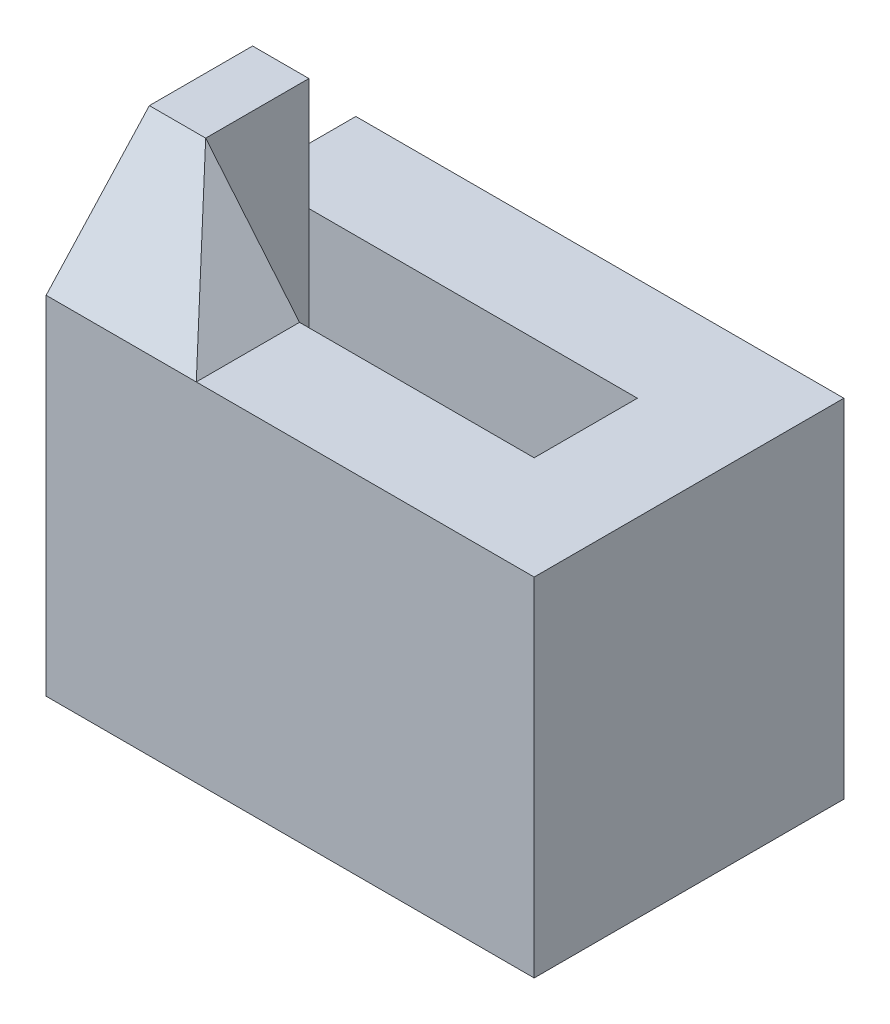
ISO-10303-21;
HEADER;
FILE_DESCRIPTION(('STEP AP214'),'2;1');
FILE_NAME('part.step','',(''),(''),'','','');
FILE_SCHEMA(('AUTOMOTIVE_DESIGN { 1 0 10303 214 1 1 1 1 }'));
ENDSEC;
DATA;
#1=APPLICATION_CONTEXT('core data for automotive mechanical design processes');
#2=APPLICATION_PROTOCOL_DEFINITION('international standard','automotive_design',2000,#1);
#3=PRODUCT_CONTEXT('',#1,'mechanical');
#4=PRODUCT('Part','Part','',(#3));
#5=PRODUCT_RELATED_PRODUCT_CATEGORY('part','',(#4));
#6=PRODUCT_DEFINITION_FORMATION('','',#4);
#7=PRODUCT_DEFINITION_CONTEXT('part definition',#1,'design');
#8=PRODUCT_DEFINITION('design','',#6,#7);
#9=PRODUCT_DEFINITION_SHAPE('','',#8);
#10=(LENGTH_UNIT() NAMED_UNIT(*) SI_UNIT(.MILLI.,.METRE.));
#11=(NAMED_UNIT(*) PLANE_ANGLE_UNIT() SI_UNIT($,.RADIAN.));
#12=(NAMED_UNIT(*) SI_UNIT($,.STERADIAN.) SOLID_ANGLE_UNIT());
#13=UNCERTAINTY_MEASURE_WITH_UNIT(LENGTH_MEASURE(1.E-05),#10,'distance_accuracy_value','');
#14=(GEOMETRIC_REPRESENTATION_CONTEXT(3) GLOBAL_UNCERTAINTY_ASSIGNED_CONTEXT((#13)) GLOBAL_UNIT_ASSIGNED_CONTEXT((#10,
#11,#12)) REPRESENTATION_CONTEXT('',''));
#15=CARTESIAN_POINT('',(0.,0.,0.));
#16=DIRECTION('',(0.,0.,1.));
#17=DIRECTION('',(1.,0.,0.));
#18=AXIS2_PLACEMENT_3D('',#15,#16,#17);
#19=CARTESIAN_POINT('',(0.,37.,0.));
#20=DIRECTION('',(0.,1.,0.));
#21=DIRECTION('',(0.,0.,1.));
#22=AXIS2_PLACEMENT_3D('',#19,#20,#21);
#23=PLANE('',#22);
#24=DIRECTION('',(1.,0.,0.));
#25=VECTOR('',#24,1.);
#26=CARTESIAN_POINT('',(-20.,37.,5.5));
#27=LINE('',#26,#25);
#28=CARTESIAN_POINT('',(-10.,37.,5.5));
#29=VERTEX_POINT('',#28);
#30=CARTESIAN_POINT('',(15.,37.,5.5));
#31=VERTEX_POINT('',#30);
#32=EDGE_CURVE('E155',#29,#31,#27,.T.);
#33=ORIENTED_EDGE('',*,*,#32,.F.);
#34=DIRECTION('',(0.,0.,1.));
#35=VECTOR('',#34,1.);
#36=CARTESIAN_POINT('',(-10.,37.,16.5));
#37=LINE('',#36,#35);
#38=CARTESIAN_POINT('',(-10.,37.,16.5));
#39=VERTEX_POINT('',#38);
#40=EDGE_CURVE('E141',#29,#39,#37,.T.);
#41=ORIENTED_EDGE('',*,*,#40,.T.);
#42=DIRECTION('',(1.,0.,0.));
#43=VECTOR('',#42,1.);
#44=CARTESIAN_POINT('',(-26.,37.,16.5));
#45=LINE('',#44,#43);
#46=CARTESIAN_POINT('',(26.,37.,16.5));
#47=VERTEX_POINT('',#46);
#48=EDGE_CURVE('E86',#39,#47,#45,.T.);
#49=ORIENTED_EDGE('',*,*,#48,.T.);
#50=DIRECTION('',(0.,0.,-1.));
#51=VECTOR('',#50,1.);
#52=CARTESIAN_POINT('',(26.,37.,-16.5));
#53=LINE('',#52,#51);
#54=CARTESIAN_POINT('',(26.,37.,-16.5));
#55=VERTEX_POINT('',#54);
#56=EDGE_CURVE('E300',#47,#55,#53,.T.);
#57=ORIENTED_EDGE('',*,*,#56,.T.);
#58=DIRECTION('',(-1.,0.,0.));
#59=VECTOR('',#58,1.);
#60=CARTESIAN_POINT('',(-26.,37.,-16.5));
#61=LINE('',#60,#59);
#62=CARTESIAN_POINT('',(-26.,37.,-16.5));
#63=VERTEX_POINT('',#62);
#64=EDGE_CURVE('E61',#55,#63,#61,.T.);
#65=ORIENTED_EDGE('',*,*,#64,.T.);
#66=DIRECTION('',(0.,0.,1.));
#67=VECTOR('',#66,1.);
#68=CARTESIAN_POINT('',(-26.,37.,-16.5));
#69=LINE('',#68,#67);
#70=CARTESIAN_POINT('',(-26.,37.,-5.5));
#71=VERTEX_POINT('',#70);
#72=EDGE_CURVE('E195',#63,#71,#69,.T.);
#73=ORIENTED_EDGE('',*,*,#72,.T.);
#74=DIRECTION('',(-1.,0.,0.));
#75=VECTOR('',#74,1.);
#76=CARTESIAN_POINT('',(-20.,37.,-5.5));
#77=LINE('',#76,#75);
#78=CARTESIAN_POINT('',(-20.,37.,-5.5));
#79=VERTEX_POINT('',#78);
#80=EDGE_CURVE('E149',#79,#71,#77,.T.);
#81=ORIENTED_EDGE('',*,*,#80,.F.);
#82=DIRECTION('',(-1.,0.,0.));
#83=VECTOR('',#82,1.);
#84=CARTESIAN_POINT('',(-20.,37.,-5.5));
#85=LINE('',#84,#83);
#86=CARTESIAN_POINT('',(15.,37.,-5.5));
#87=VERTEX_POINT('',#86);
#88=EDGE_CURVE('E163',#87,#79,#85,.T.);
#89=ORIENTED_EDGE('',*,*,#88,.F.);
#90=DIRECTION('',(0.,0.,-1.));
#91=VECTOR('',#90,1.);
#92=CARTESIAN_POINT('',(15.,37.,-5.5));
#93=LINE('',#92,#91);
#94=EDGE_CURVE('E162',#31,#87,#93,.T.);
#95=ORIENTED_EDGE('',*,*,#94,.F.);
#96=EDGE_LOOP('',(#33,#41,#49,#57,#65,#73,#81,#89,#95));
#97=FACE_BOUND('',#96,.T.);
#98=ADVANCED_FACE('F35',(#97),#23,.T.);
#99=CARTESIAN_POINT('',(2.,37.,-5.5));
#100=DIRECTION('',(-1.,0.,0.));
#101=DIRECTION('',(0.,0.,1.));
#102=AXIS2_PLACEMENT_3D('',#99,#100,#101);
#103=PLANE('',#102);
#104=DIRECTION('',(0.,-1.,0.));
#105=VECTOR('',#104,1.);
#106=CARTESIAN_POINT('',(2.,37.,5.5));
#107=LINE('',#106,#105);
#108=CARTESIAN_POINT('',(2.,24.,5.5));
#109=VERTEX_POINT('',#108);
#110=CARTESIAN_POINT('',(2.,0.,5.5));
#111=VERTEX_POINT('',#110);
#112=EDGE_CURVE('E186',#109,#111,#107,.T.);
#113=ORIENTED_EDGE('',*,*,#112,.F.);
#114=DIRECTION('',(0.,0.,1.));
#115=VECTOR('',#114,1.);
#116=CARTESIAN_POINT('',(2.,24.,-5.5));
#117=LINE('',#116,#115);
#118=CARTESIAN_POINT('',(2.,24.,-5.5));
#119=VERTEX_POINT('',#118);
#120=EDGE_CURVE('E210',#119,#109,#117,.T.);
#121=ORIENTED_EDGE('',*,*,#120,.F.);
#122=DIRECTION('',(0.,-1.,0.));
#123=VECTOR('',#122,1.);
#124=CARTESIAN_POINT('',(2.,37.,-5.5));
#125=LINE('',#124,#123);
#126=CARTESIAN_POINT('',(2.,0.,-5.5));
#127=VERTEX_POINT('',#126);
#128=EDGE_CURVE('E184',#119,#127,#125,.T.);
#129=ORIENTED_EDGE('',*,*,#128,.T.);
#130=DIRECTION('',(0.,0.,-1.));
#131=VECTOR('',#130,1.);
#132=CARTESIAN_POINT('',(2.,0.,-5.5));
#133=LINE('',#132,#131);
#134=EDGE_CURVE('E170',#111,#127,#133,.T.);
#135=ORIENTED_EDGE('',*,*,#134,.F.);
#136=EDGE_LOOP('',(#113,#121,#129,#135));
#137=FACE_BOUND('',#136,.T.);
#138=ADVANCED_FACE('F234',(#137),#103,.T.);
#139=CARTESIAN_POINT('',(0.,0.,0.));
#140=DIRECTION('',(0.,1.,0.));
#141=DIRECTION('',(0.,0.,1.));
#142=AXIS2_PLACEMENT_3D('',#139,#140,#141);
#143=PLANE('',#142);
#144=DIRECTION('',(0.,0.,1.));
#145=VECTOR('',#144,1.);
#146=CARTESIAN_POINT('',(-26.,0.,-16.5));
#147=LINE('',#146,#145);
#148=CARTESIAN_POINT('',(-26.,0.,-16.5));
#149=VERTEX_POINT('',#148);
#150=CARTESIAN_POINT('',(-26.,0.,16.5));
#151=VERTEX_POINT('',#150);
#152=EDGE_CURVE('E189',#149,#151,#147,.T.);
#153=ORIENTED_EDGE('',*,*,#152,.F.);
#154=DIRECTION('',(-1.,0.,0.));
#155=VECTOR('',#154,1.);
#156=CARTESIAN_POINT('',(-26.,0.,-16.5));
#157=LINE('',#156,#155);
#158=CARTESIAN_POINT('',(26.,0.,-16.5));
#159=VERTEX_POINT('',#158);
#160=EDGE_CURVE('E81',#159,#149,#157,.T.);
#161=ORIENTED_EDGE('',*,*,#160,.F.);
#162=DIRECTION('',(0.,0.,-1.));
#163=VECTOR('',#162,1.);
#164=CARTESIAN_POINT('',(26.,0.,-16.5));
#165=LINE('',#164,#163);
#166=CARTESIAN_POINT('',(26.,0.,16.5));
#167=VERTEX_POINT('',#166);
#168=EDGE_CURVE('E297',#167,#159,#165,.T.);
#169=ORIENTED_EDGE('',*,*,#168,.F.);
#170=DIRECTION('',(1.,0.,0.));
#171=VECTOR('',#170,1.);
#172=CARTESIAN_POINT('',(-26.,0.,16.5));
#173=LINE('',#172,#171);
#174=EDGE_CURVE('E290',#151,#167,#173,.T.);
#175=ORIENTED_EDGE('',*,*,#174,.F.);
#176=EDGE_LOOP('',(#153,#161,#169,#175));
#177=FACE_BOUND('',#176,.T.);
#178=DIRECTION('',(0.,0.,1.));
#179=VECTOR('',#178,1.);
#180=CARTESIAN_POINT('',(-20.,0.,-5.5));
#181=LINE('',#180,#179);
#182=CARTESIAN_POINT('',(-20.,0.,-5.5));
#183=VERTEX_POINT('',#182);
#184=CARTESIAN_POINT('',(-20.,0.,5.5));
#185=VERTEX_POINT('',#184);
#186=EDGE_CURVE('E52',#183,#185,#181,.T.);
#187=ORIENTED_EDGE('',*,*,#186,.T.);
#188=DIRECTION('',(1.,0.,0.));
#189=VECTOR('',#188,1.);
#190=CARTESIAN_POINT('',(-20.,0.,5.5));
#191=LINE('',#190,#189);
#192=EDGE_CURVE('E177',#185,#111,#191,.T.);
#193=ORIENTED_EDGE('',*,*,#192,.T.);
#194=ORIENTED_EDGE('',*,*,#134,.T.);
#195=DIRECTION('',(-1.,0.,0.));
#196=VECTOR('',#195,1.);
#197=CARTESIAN_POINT('',(-20.,0.,-5.5));
#198=LINE('',#197,#196);
#199=EDGE_CURVE('E164',#127,#183,#198,.T.);
#200=ORIENTED_EDGE('',*,*,#199,.T.);
#201=EDGE_LOOP('',(#187,#193,#194,#200));
#202=FACE_BOUND('',#201,.T.);
#203=ADVANCED_FACE('F237',(#177,#202),#143,.F.);
#204=CARTESIAN_POINT('',(-26.,37.,-16.5));
#205=DIRECTION('',(1.,0.,0.));
#206=DIRECTION('',(0.,0.,-1.));
#207=AXIS2_PLACEMENT_3D('',#204,#205,#206);
#208=PLANE('',#207);
#209=DIRECTION('',(0.,-1.,0.));
#210=VECTOR('',#209,1.);
#211=CARTESIAN_POINT('',(-26.,37.,16.5));
#212=LINE('',#211,#210);
#213=CARTESIAN_POINT('',(-26.,37.,16.5));
#214=VERTEX_POINT('',#213);
#215=EDGE_CURVE('E11',#214,#151,#212,.T.);
#216=ORIENTED_EDGE('',*,*,#215,.F.);
#217=DIRECTION('',(0.,0.737154140200742,-0.675724628517346));
#218=VECTOR('',#217,1.);
#219=CARTESIAN_POINT('',(-26.,49.,5.5));
#220=LINE('',#219,#218);
#221=CARTESIAN_POINT('',(-26.,49.,5.5));
#222=VERTEX_POINT('',#221);
#223=EDGE_CURVE('E150',#214,#222,#220,.T.);
#224=ORIENTED_EDGE('',*,*,#223,.T.);
#225=DIRECTION('',(0.,0.,1.));
#226=VECTOR('',#225,1.);
#227=CARTESIAN_POINT('',(-26.,49.,-5.5));
#228=LINE('',#227,#226);
#229=CARTESIAN_POINT('',(-26.,49.,-5.5));
#230=VERTEX_POINT('',#229);
#231=EDGE_CURVE('E245',#230,#222,#228,.T.);
#232=ORIENTED_EDGE('',*,*,#231,.F.);
#233=DIRECTION('',(0.,-1.,0.));
#234=VECTOR('',#233,1.);
#235=CARTESIAN_POINT('',(-26.,49.,-5.5));
#236=LINE('',#235,#234);
#237=EDGE_CURVE('E201',#230,#71,#236,.T.);
#238=ORIENTED_EDGE('',*,*,#237,.T.);
#239=ORIENTED_EDGE('',*,*,#72,.F.);
#240=DIRECTION('',(0.,-1.,0.));
#241=VECTOR('',#240,1.);
#242=CARTESIAN_POINT('',(-26.,37.,-16.5));
#243=LINE('',#242,#241);
#244=EDGE_CURVE('E306',#63,#149,#243,.T.);
#245=ORIENTED_EDGE('',*,*,#244,.T.);
#246=ORIENTED_EDGE('',*,*,#152,.T.);
#247=EDGE_LOOP('',(#216,#224,#232,#238,#239,#245,#246));
#248=FACE_BOUND('',#247,.T.);
#249=ADVANCED_FACE('F37',(#248),#208,.F.);
#250=CARTESIAN_POINT('',(-26.,37.,16.5));
#251=DIRECTION('',(0.,0.,-1.));
#252=DIRECTION('',(-1.,0.,0.));
#253=AXIS2_PLACEMENT_3D('',#250,#251,#252);
#254=PLANE('',#253);
#255=ORIENTED_EDGE('',*,*,#174,.T.);
#256=DIRECTION('',(0.,-1.,0.));
#257=VECTOR('',#256,1.);
#258=CARTESIAN_POINT('',(26.,37.,16.5));
#259=LINE('',#258,#257);
#260=EDGE_CURVE('E44',#47,#167,#259,.T.);
#261=ORIENTED_EDGE('',*,*,#260,.F.);
#262=ORIENTED_EDGE('',*,*,#48,.F.);
#263=EDGE_CURVE('E192',#214,#39,#45,.T.);
#264=ORIENTED_EDGE('',*,*,#263,.F.);
#265=ORIENTED_EDGE('',*,*,#215,.T.);
#266=EDGE_LOOP('',(#255,#261,#262,#264,#265));
#267=FACE_BOUND('',#266,.T.);
#268=ADVANCED_FACE('F283',(#267),#254,.F.);
#269=CARTESIAN_POINT('',(26.,37.,-16.5));
#270=DIRECTION('',(-1.,0.,0.));
#271=DIRECTION('',(0.,0.,1.));
#272=AXIS2_PLACEMENT_3D('',#269,#270,#271);
#273=PLANE('',#272);
#274=ORIENTED_EDGE('',*,*,#168,.T.);
#275=DIRECTION('',(0.,-1.,0.));
#276=VECTOR('',#275,1.);
#277=CARTESIAN_POINT('',(26.,37.,-16.5));
#278=LINE('',#277,#276);
#279=EDGE_CURVE('E301',#55,#159,#278,.T.);
#280=ORIENTED_EDGE('',*,*,#279,.F.);
#281=ORIENTED_EDGE('',*,*,#56,.F.);
#282=ORIENTED_EDGE('',*,*,#260,.T.);
#283=EDGE_LOOP('',(#274,#280,#281,#282));
#284=FACE_BOUND('',#283,.T.);
#285=ADVANCED_FACE('F281',(#284),#273,.F.);
#286=CARTESIAN_POINT('',(-26.,37.,-16.5));
#287=DIRECTION('',(0.,0.,1.));
#288=DIRECTION('',(1.,0.,0.));
#289=AXIS2_PLACEMENT_3D('',#286,#287,#288);
#290=PLANE('',#289);
#291=ORIENTED_EDGE('',*,*,#160,.T.);
#292=ORIENTED_EDGE('',*,*,#244,.F.);
#293=ORIENTED_EDGE('',*,*,#64,.F.);
#294=ORIENTED_EDGE('',*,*,#279,.T.);
#295=EDGE_LOOP('',(#291,#292,#293,#294));
#296=FACE_BOUND('',#295,.T.);
#297=ADVANCED_FACE('F278',(#296),#290,.F.);
#298=CARTESIAN_POINT('',(-20.,37.,-5.5));
#299=DIRECTION('',(1.,0.,0.));
#300=DIRECTION('',(0.,0.,-1.));
#301=AXIS2_PLACEMENT_3D('',#298,#299,#300);
#302=PLANE('',#301);
#303=ORIENTED_EDGE('',*,*,#186,.F.);
#304=DIRECTION('',(0.,-1.,0.));
#305=VECTOR('',#304,1.);
#306=CARTESIAN_POINT('',(-20.,37.,-5.5));
#307=LINE('',#306,#305);
#308=EDGE_CURVE('E167',#79,#183,#307,.T.);
#309=ORIENTED_EDGE('',*,*,#308,.F.);
#310=DIRECTION('',(0.,-1.,0.));
#311=VECTOR('',#310,1.);
#312=CARTESIAN_POINT('',(-20.,49.,-5.5));
#313=LINE('',#312,#311);
#314=CARTESIAN_POINT('',(-20.,49.,-5.5));
#315=VERTEX_POINT('',#314);
#316=EDGE_CURVE('E207',#315,#79,#313,.T.);
#317=ORIENTED_EDGE('',*,*,#316,.F.);
#318=DIRECTION('',(0.,0.,-1.));
#319=VECTOR('',#318,1.);
#320=CARTESIAN_POINT('',(-20.,49.,-5.5));
#321=LINE('',#320,#319);
#322=CARTESIAN_POINT('',(-20.,49.,5.5));
#323=VERTEX_POINT('',#322);
#324=EDGE_CURVE('E200',#323,#315,#321,.T.);
#325=ORIENTED_EDGE('',*,*,#324,.F.);
#326=DIRECTION('',(0.,-1.,0.));
#327=VECTOR('',#326,1.);
#328=CARTESIAN_POINT('',(-20.,37.,5.5));
#329=LINE('',#328,#327);
#330=EDGE_CURVE('E157',#323,#185,#329,.T.);
#331=ORIENTED_EDGE('',*,*,#330,.T.);
#332=EDGE_LOOP('',(#303,#309,#317,#325,#331));
#333=FACE_BOUND('',#332,.T.);
#334=ADVANCED_FACE('F239',(#333),#302,.T.);
#335=CARTESIAN_POINT('',(-20.,37.,5.5));
#336=DIRECTION('',(0.,0.,-1.));
#337=DIRECTION('',(-1.,0.,0.));
#338=AXIS2_PLACEMENT_3D('',#335,#336,#337);
#339=PLANE('',#338);
#340=DIRECTION('',(0.64018439966448,-0.768221279597376,0.));
#341=VECTOR('',#340,1.);
#342=CARTESIAN_POINT('',(-20.,49.,5.5));
#343=LINE('',#342,#341);
#344=EDGE_CURVE('E144',#323,#29,#343,.T.);
#345=ORIENTED_EDGE('',*,*,#344,.T.);
#346=ORIENTED_EDGE('',*,*,#32,.T.);
#347=DIRECTION('',(0.,1.,0.));
#348=VECTOR('',#347,1.);
#349=CARTESIAN_POINT('',(15.,24.,5.5));
#350=LINE('',#349,#348);
#351=CARTESIAN_POINT('',(15.,24.,5.5));
#352=VERTEX_POINT('',#351);
#353=EDGE_CURVE('E173',#352,#31,#350,.T.);
#354=ORIENTED_EDGE('',*,*,#353,.F.);
#355=DIRECTION('',(1.,0.,0.));
#356=VECTOR('',#355,1.);
#357=CARTESIAN_POINT('',(2.,24.,5.5));
#358=LINE('',#357,#356);
#359=EDGE_CURVE('E213',#109,#352,#358,.T.);
#360=ORIENTED_EDGE('',*,*,#359,.F.);
#361=ORIENTED_EDGE('',*,*,#112,.T.);
#362=ORIENTED_EDGE('',*,*,#192,.F.);
#363=ORIENTED_EDGE('',*,*,#330,.F.);
#364=EDGE_LOOP('',(#345,#346,#354,#360,#361,#362,#363));
#365=FACE_BOUND('',#364,.T.);
#366=ADVANCED_FACE('F154',(#365),#339,.T.);
#367=CARTESIAN_POINT('',(-20.,37.,-5.5));
#368=DIRECTION('',(0.,0.,1.));
#369=DIRECTION('',(1.,0.,0.));
#370=AXIS2_PLACEMENT_3D('',#367,#368,#369);
#371=PLANE('',#370);
#372=ORIENTED_EDGE('',*,*,#199,.F.);
#373=ORIENTED_EDGE('',*,*,#128,.F.);
#374=DIRECTION('',(-1.,0.,0.));
#375=VECTOR('',#374,1.);
#376=CARTESIAN_POINT('',(2.,24.,-5.5));
#377=LINE('',#376,#375);
#378=CARTESIAN_POINT('',(15.,24.,-5.5));
#379=VERTEX_POINT('',#378);
#380=EDGE_CURVE('E219',#379,#119,#377,.T.);
#381=ORIENTED_EDGE('',*,*,#380,.F.);
#382=DIRECTION('',(0.,1.,0.));
#383=VECTOR('',#382,1.);
#384=CARTESIAN_POINT('',(15.,24.,-5.5));
#385=LINE('',#384,#383);
#386=EDGE_CURVE('E178',#379,#87,#385,.T.);
#387=ORIENTED_EDGE('',*,*,#386,.T.);
#388=ORIENTED_EDGE('',*,*,#88,.T.);
#389=ORIENTED_EDGE('',*,*,#308,.T.);
#390=EDGE_LOOP('',(#372,#373,#381,#387,#388,#389));
#391=FACE_BOUND('',#390,.T.);
#392=ADVANCED_FACE('F258',(#391),#371,.T.);
#393=CARTESIAN_POINT('',(15.,24.,-5.5));
#394=DIRECTION('',(1.,0.,0.));
#395=DIRECTION('',(0.,0.,-1.));
#396=AXIS2_PLACEMENT_3D('',#393,#394,#395);
#397=PLANE('',#396);
#398=ORIENTED_EDGE('',*,*,#94,.T.);
#399=ORIENTED_EDGE('',*,*,#386,.F.);
#400=DIRECTION('',(0.,0.,-1.));
#401=VECTOR('',#400,1.);
#402=CARTESIAN_POINT('',(15.,24.,-5.5));
#403=LINE('',#402,#401);
#404=EDGE_CURVE('E216',#352,#379,#403,.T.);
#405=ORIENTED_EDGE('',*,*,#404,.F.);
#406=ORIENTED_EDGE('',*,*,#353,.T.);
#407=EDGE_LOOP('',(#398,#399,#405,#406));
#408=FACE_BOUND('',#407,.T.);
#409=ADVANCED_FACE('F226',(#408),#397,.F.);
#410=CARTESIAN_POINT('',(0.,24.,0.));
#411=DIRECTION('',(0.,1.,0.));
#412=DIRECTION('',(0.,0.,1.));
#413=AXIS2_PLACEMENT_3D('',#410,#411,#412);
#414=PLANE('',#413);
#415=ORIENTED_EDGE('',*,*,#120,.T.);
#416=ORIENTED_EDGE('',*,*,#359,.T.);
#417=ORIENTED_EDGE('',*,*,#404,.T.);
#418=ORIENTED_EDGE('',*,*,#380,.T.);
#419=EDGE_LOOP('',(#415,#416,#417,#418));
#420=FACE_BOUND('',#419,.T.);
#421=ADVANCED_FACE('F231',(#420),#414,.T.);
#422=CARTESIAN_POINT('',(-20.,49.,-5.5));
#423=DIRECTION('',(0.,0.,1.));
#424=DIRECTION('',(1.,0.,0.));
#425=AXIS2_PLACEMENT_3D('',#422,#423,#424);
#426=PLANE('',#425);
#427=ORIENTED_EDGE('',*,*,#80,.T.);
#428=ORIENTED_EDGE('',*,*,#237,.F.);
#429=DIRECTION('',(-1.,0.,0.));
#430=VECTOR('',#429,1.);
#431=CARTESIAN_POINT('',(-20.,49.,-5.5));
#432=LINE('',#431,#430);
#433=EDGE_CURVE('E243',#315,#230,#432,.T.);
#434=ORIENTED_EDGE('',*,*,#433,.F.);
#435=ORIENTED_EDGE('',*,*,#316,.T.);
#436=EDGE_LOOP('',(#427,#428,#434,#435));
#437=FACE_BOUND('',#436,.T.);
#438=ADVANCED_FACE('F257',(#437),#426,.F.);
#439=CARTESIAN_POINT('',(0.,49.,0.));
#440=DIRECTION('',(0.,-1.,0.));
#441=DIRECTION('',(0.,0.,-1.));
#442=AXIS2_PLACEMENT_3D('',#439,#440,#441);
#443=PLANE('',#442);
#444=ORIENTED_EDGE('',*,*,#324,.T.);
#445=ORIENTED_EDGE('',*,*,#433,.T.);
#446=ORIENTED_EDGE('',*,*,#231,.T.);
#447=DIRECTION('',(1.,0.,0.));
#448=VECTOR('',#447,1.);
#449=CARTESIAN_POINT('',(-20.,49.,5.5));
#450=LINE('',#449,#448);
#451=EDGE_CURVE('E205',#222,#323,#450,.T.);
#452=ORIENTED_EDGE('',*,*,#451,.T.);
#453=EDGE_LOOP('',(#444,#445,#446,#452));
#454=FACE_BOUND('',#453,.T.);
#455=ADVANCED_FACE('F313',(#454),#443,.F.);
#456=CARTESIAN_POINT('',(-10.,49.,5.5));
#457=DIRECTION('',(0.,0.675724628517346,0.737154140200741));
#458=DIRECTION('',(0.,-0.737154140200741,0.675724628517346));
#459=AXIS2_PLACEMENT_3D('',#456,#457,#458);
#460=PLANE('',#459);
#461=DIRECTION('',(-0.523423922590214,0.628108707108257,-0.575766314849235));
#462=VECTOR('',#461,1.);
#463=CARTESIAN_POINT('',(-26.630445890411,56.9565350684932,-1.79349047945206));
#464=LINE('',#463,#462);
#465=EDGE_CURVE('E146',#39,#323,#464,.T.);
#466=ORIENTED_EDGE('',*,*,#465,.T.);
#467=ORIENTED_EDGE('',*,*,#451,.F.);
#468=ORIENTED_EDGE('',*,*,#223,.F.);
#469=ORIENTED_EDGE('',*,*,#263,.T.);
#470=EDGE_LOOP('',(#466,#467,#468,#469));
#471=FACE_BOUND('',#470,.T.);
#472=ADVANCED_FACE('F310',(#471),#460,.T.);
#473=CARTESIAN_POINT('',(-20.,49.,-16.501025));
#474=DIRECTION('',(-0.768221279597376,-0.64018439966448,0.));
#475=DIRECTION('',(0.64018439966448,-0.768221279597376,0.));
#476=AXIS2_PLACEMENT_3D('',#473,#474,#475);
#477=PLANE('',#476);
#478=ORIENTED_EDGE('',*,*,#465,.F.);
#479=ORIENTED_EDGE('',*,*,#40,.F.);
#480=ORIENTED_EDGE('',*,*,#344,.F.);
#481=EDGE_LOOP('',(#478,#479,#480));
#482=FACE_BOUND('',#481,.T.);
#483=ADVANCED_FACE('F143',(#482),#477,.F.);
#484=CLOSED_SHELL('',(#98,#138,#203,#249,#268,#285,#297,#334,#366,#392,#409,#421,#438,#455,#472,#483));
#485=MANIFOLD_SOLID_BREP('B2',#484);
#486=ADVANCED_BREP_SHAPE_REPRESENTATION('',(#18,#485),#14);
#487=SHAPE_DEFINITION_REPRESENTATION(#9,#486);
ENDSEC;
END-ISO-10303-21;
